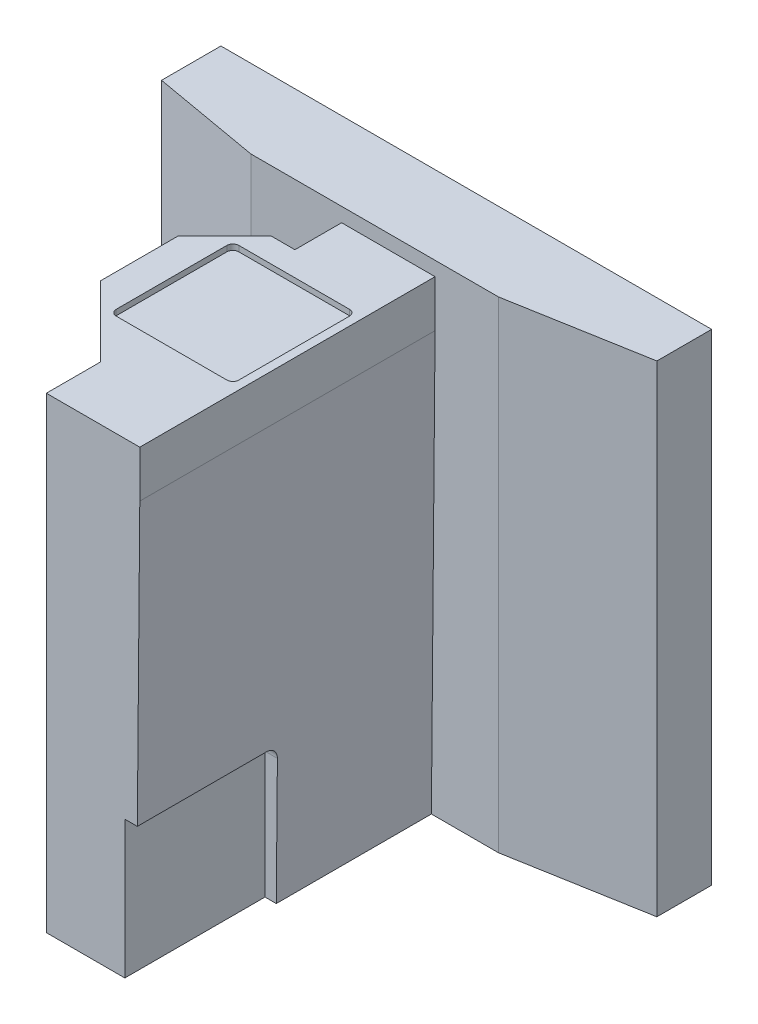
ISO-10303-21;
HEADER;
FILE_DESCRIPTION(('STEP AP214'),'2;1');
FILE_NAME('part.step','',(''),(''),'','','');
FILE_SCHEMA(('AUTOMOTIVE_DESIGN { 1 0 10303 214 1 1 1 1 }'));
ENDSEC;
DATA;
#1=APPLICATION_CONTEXT('core data for automotive mechanical design processes');
#2=APPLICATION_PROTOCOL_DEFINITION('international standard','automotive_design',2000,#1);
#3=PRODUCT_CONTEXT('',#1,'mechanical');
#4=PRODUCT('Part','Part','',(#3));
#5=PRODUCT_RELATED_PRODUCT_CATEGORY('part','',(#4));
#6=PRODUCT_DEFINITION_FORMATION('','',#4);
#7=PRODUCT_DEFINITION_CONTEXT('part definition',#1,'design');
#8=PRODUCT_DEFINITION('design','',#6,#7);
#9=PRODUCT_DEFINITION_SHAPE('','',#8);
#10=(LENGTH_UNIT() NAMED_UNIT(*) SI_UNIT(.MILLI.,.METRE.));
#11=(NAMED_UNIT(*) PLANE_ANGLE_UNIT() SI_UNIT($,.RADIAN.));
#12=(NAMED_UNIT(*) SI_UNIT($,.STERADIAN.) SOLID_ANGLE_UNIT());
#13=UNCERTAINTY_MEASURE_WITH_UNIT(LENGTH_MEASURE(1.E-05),#10,'distance_accuracy_value','');
#14=(GEOMETRIC_REPRESENTATION_CONTEXT(3) GLOBAL_UNCERTAINTY_ASSIGNED_CONTEXT((#13)) GLOBAL_UNIT_ASSIGNED_CONTEXT((#10,
#11,#12)) REPRESENTATION_CONTEXT('',''));
#15=CARTESIAN_POINT('',(0.,0.,0.));
#16=DIRECTION('',(0.,0.,1.));
#17=DIRECTION('',(1.,0.,0.));
#18=AXIS2_PLACEMENT_3D('',#15,#16,#17);
#19=CARTESIAN_POINT('',(16.6751,32.7152000000001,5.334));
#20=DIRECTION('',(0.,0.,-1.));
#21=DIRECTION('',(-1.,0.,0.));
#22=AXIS2_PLACEMENT_3D('',#19,#20,#21);
#23=PLANE('',#22);
#24=DIRECTION('',(1.,0.,0.));
#25=VECTOR('',#24,1.);
#26=CARTESIAN_POINT('',(16.6751,0.,5.334));
#27=LINE('',#26,#25);
#28=CARTESIAN_POINT('',(2.96372975287907,0.,5.334));
#29=VERTEX_POINT('',#28);
#30=CARTESIAN_POINT('',(7.53109999999983,0.,5.334));
#31=VERTEX_POINT('',#30);
#32=EDGE_CURVE('E323',#29,#31,#27,.T.);
#33=ORIENTED_EDGE('',*,*,#32,.T.);
#34=DIRECTION('',(0.,1.,0.));
#35=VECTOR('',#34,1.);
#36=CARTESIAN_POINT('',(7.53109999999985,32.7152000000001,5.334));
#37=LINE('',#36,#35);
#38=CARTESIAN_POINT('',(7.53109999999985,32.7152000000001,5.334));
#39=VERTEX_POINT('',#38);
#40=EDGE_CURVE('E393',#31,#39,#37,.T.);
#41=ORIENTED_EDGE('',*,*,#40,.T.);
#42=DIRECTION('',(1.,0.,0.));
#43=VECTOR('',#42,1.);
#44=CARTESIAN_POINT('',(16.6751,32.7152000000001,5.334));
#45=LINE('',#44,#43);
#46=CARTESIAN_POINT('',(-9.30909999999983,32.7152000000001,5.334));
#47=VERTEX_POINT('',#46);
#48=EDGE_CURVE('E308',#47,#39,#45,.T.);
#49=ORIENTED_EDGE('',*,*,#48,.F.);
#50=DIRECTION('',(0.,-1.,0.));
#51=VECTOR('',#50,1.);
#52=CARTESIAN_POINT('',(-9.30909999999983,32.7152000000001,5.334));
#53=LINE('',#52,#51);
#54=CARTESIAN_POINT('',(-9.30909999999985,0.,5.334));
#55=VERTEX_POINT('',#54);
#56=EDGE_CURVE('E349',#47,#55,#53,.T.);
#57=ORIENTED_EDGE('',*,*,#56,.T.);
#58=CARTESIAN_POINT('',(-3.13689999999999,0.,5.334));
#59=VERTEX_POINT('',#58);
#60=EDGE_CURVE('E324',#55,#59,#27,.T.);
#61=ORIENTED_EDGE('',*,*,#60,.T.);
#62=DIRECTION('',(0.,-1.,0.));
#63=VECTOR('',#62,1.);
#64=CARTESIAN_POINT('',(-3.13689999999997,28.5750000000001,5.334));
#65=LINE('',#64,#63);
#66=CARTESIAN_POINT('',(-3.13689999999997,31.7500000000001,5.334));
#67=VERTEX_POINT('',#66);
#68=EDGE_CURVE('E299',#67,#59,#65,.T.);
#69=ORIENTED_EDGE('',*,*,#68,.F.);
#70=DIRECTION('',(-1.,0.,0.));
#71=VECTOR('',#70,1.);
#72=CARTESIAN_POINT('',(3.21310000000003,31.7500000000001,5.334));
#73=LINE('',#72,#71);
#74=CARTESIAN_POINT('',(3.21310000000003,31.7500000000001,5.334));
#75=VERTEX_POINT('',#74);
#76=EDGE_CURVE('E589',#75,#67,#73,.T.);
#77=ORIENTED_EDGE('',*,*,#76,.F.);
#78=DIRECTION('',(0.,-1.,0.));
#79=VECTOR('',#78,1.);
#80=CARTESIAN_POINT('',(3.21310000000005,55.6589231294315,5.334));
#81=LINE('',#80,#79);
#82=CARTESIAN_POINT('',(3.21310000000003,28.5750000000001,5.334));
#83=VERTEX_POINT('',#82);
#84=EDGE_CURVE('E621',#75,#83,#81,.T.);
#85=ORIENTED_EDGE('',*,*,#84,.T.);
#86=DIRECTION('',(0.00872653549837484,0.999961923064175,0.));
#87=VECTOR('',#86,1.);
#88=CARTESIAN_POINT('',(3.21310000000003,28.5750000000001,5.334));
#89=LINE('',#88,#87);
#90=EDGE_CURVE('E355',#83,#29,#89,.F.);
#91=ORIENTED_EDGE('',*,*,#90,.T.);
#92=EDGE_LOOP('',(#33,#41,#49,#57,#61,#69,#77,#85,#91));
#93=FACE_BOUND('',#92,.T.);
#94=ADVANCED_FACE('F48',(#93),#23,.F.);
#95=CARTESIAN_POINT('',(-16.6751,32.7152000000001,5.334));
#96=DIRECTION('',(1.,0.,0.));
#97=DIRECTION('',(0.,0.,-1.));
#98=AXIS2_PLACEMENT_3D('',#95,#96,#97);
#99=PLANE('',#98);
#100=DIRECTION('',(0.,0.,1.));
#101=VECTOR('',#100,1.);
#102=CARTESIAN_POINT('',(-16.6751,0.,5.334));
#103=LINE('',#102,#101);
#104=CARTESIAN_POINT('',(-16.6751,0.,0.));
#105=VERTEX_POINT('',#104);
#106=CARTESIAN_POINT('',(-16.6751,0.,4.03517546010146));
#107=VERTEX_POINT('',#106);
#108=EDGE_CURVE('E303',#105,#107,#103,.T.);
#109=ORIENTED_EDGE('',*,*,#108,.T.);
#110=DIRECTION('',(0.,1.,0.));
#111=VECTOR('',#110,1.);
#112=CARTESIAN_POINT('',(-16.6751,32.7152000000001,4.03517546010146));
#113=LINE('',#112,#111);
#114=CARTESIAN_POINT('',(-16.6751,32.7152000000001,4.03517546010146));
#115=VERTEX_POINT('',#114);
#116=EDGE_CURVE('E380',#107,#115,#113,.T.);
#117=ORIENTED_EDGE('',*,*,#116,.T.);
#118=DIRECTION('',(0.,0.,1.));
#119=VECTOR('',#118,1.);
#120=CARTESIAN_POINT('',(-16.6751,32.7152000000001,5.334));
#121=LINE('',#120,#119);
#122=CARTESIAN_POINT('',(-16.6751,32.7152000000001,0.));
#123=VERTEX_POINT('',#122);
#124=EDGE_CURVE('E304',#123,#115,#121,.T.);
#125=ORIENTED_EDGE('',*,*,#124,.F.);
#126=DIRECTION('',(0.,-1.,0.));
#127=VECTOR('',#126,1.);
#128=CARTESIAN_POINT('',(-16.6751,32.7152000000001,0.));
#129=LINE('',#128,#127);
#130=EDGE_CURVE('E319',#123,#105,#129,.T.);
#131=ORIENTED_EDGE('',*,*,#130,.T.);
#132=EDGE_LOOP('',(#109,#117,#125,#131));
#133=FACE_BOUND('',#132,.T.);
#134=ADVANCED_FACE('F479',(#133),#99,.F.);
#135=CARTESIAN_POINT('',(16.6751,32.7152000000001,5.334));
#136=DIRECTION('',(-1.,0.,0.));
#137=DIRECTION('',(0.,0.,1.));
#138=AXIS2_PLACEMENT_3D('',#135,#136,#137);
#139=PLANE('',#138);
#140=DIRECTION('',(0.,0.,-1.));
#141=VECTOR('',#140,1.);
#142=CARTESIAN_POINT('',(16.6751,32.7152000000001,5.334));
#143=LINE('',#142,#141);
#144=CARTESIAN_POINT('',(16.6751,32.7152000000001,3.7216660884018));
#145=VERTEX_POINT('',#144);
#146=CARTESIAN_POINT('',(16.6751,32.7152000000001,0.));
#147=VERTEX_POINT('',#146);
#148=EDGE_CURVE('E313',#145,#147,#143,.T.);
#149=ORIENTED_EDGE('',*,*,#148,.F.);
#150=DIRECTION('',(0.,-1.,0.));
#151=VECTOR('',#150,1.);
#152=CARTESIAN_POINT('',(16.6751,32.7152000000001,3.7216660884018));
#153=LINE('',#152,#151);
#154=CARTESIAN_POINT('',(16.6751,0.,3.7216660884018));
#155=VERTEX_POINT('',#154);
#156=EDGE_CURVE('E386',#145,#155,#153,.T.);
#157=ORIENTED_EDGE('',*,*,#156,.T.);
#158=DIRECTION('',(0.,0.,-1.));
#159=VECTOR('',#158,1.);
#160=CARTESIAN_POINT('',(16.6751,0.,5.334));
#161=LINE('',#160,#159);
#162=CARTESIAN_POINT('',(16.6751,0.,0.));
#163=VERTEX_POINT('',#162);
#164=EDGE_CURVE('E327',#155,#163,#161,.T.);
#165=ORIENTED_EDGE('',*,*,#164,.T.);
#166=DIRECTION('',(0.,-1.,0.));
#167=VECTOR('',#166,1.);
#168=CARTESIAN_POINT('',(16.6751,32.7152000000001,0.));
#169=LINE('',#168,#167);
#170=EDGE_CURVE('E335',#147,#163,#169,.T.);
#171=ORIENTED_EDGE('',*,*,#170,.F.);
#172=EDGE_LOOP('',(#149,#157,#165,#171));
#173=FACE_BOUND('',#172,.T.);
#174=ADVANCED_FACE('F485',(#173),#139,.F.);
#175=CARTESIAN_POINT('',(16.6751,32.7152000000001,0.));
#176=DIRECTION('',(0.,0.,1.));
#177=DIRECTION('',(1.,0.,0.));
#178=AXIS2_PLACEMENT_3D('',#175,#176,#177);
#179=PLANE('',#178);
#180=CARTESIAN_POINT('',(0.,4.77520000000001,0.));
#181=DIRECTION('',(0.,0.,-1.));
#182=DIRECTION('',(-1.,0.,0.));
#183=AXIS2_PLACEMENT_3D('',#180,#181,#182);
#184=CIRCLE('',#183,1.24999999999999);
#185=CARTESIAN_POINT('',(-1.24999999999998,4.77520000000001,0.));
#186=VERTEX_POINT('',#185);
#187=EDGE_CURVE('E760',#186,#186,#184,.T.);
#188=ORIENTED_EDGE('',*,*,#187,.F.);
#189=EDGE_LOOP('',(#188));
#190=FACE_BOUND('',#189,.T.);
#191=CARTESIAN_POINT('',(0.,23.8252000000001,0.));
#192=DIRECTION('',(0.,0.,-1.));
#193=DIRECTION('',(-1.,0.,0.));
#194=AXIS2_PLACEMENT_3D('',#191,#192,#193);
#195=CIRCLE('',#194,1.24999999999999);
#196=CARTESIAN_POINT('',(-1.24999999999997,23.8252000000001,0.));
#197=VERTEX_POINT('',#196);
#198=EDGE_CURVE('E770',#197,#197,#195,.T.);
#199=ORIENTED_EDGE('',*,*,#198,.F.);
#200=EDGE_LOOP('',(#199));
#201=FACE_BOUND('',#200,.T.);
#202=DIRECTION('',(-1.,0.,0.));
#203=VECTOR('',#202,1.);
#204=CARTESIAN_POINT('',(16.6751,0.,0.));
#205=LINE('',#204,#203);
#206=EDGE_CURVE('E309',#163,#105,#205,.T.);
#207=ORIENTED_EDGE('',*,*,#206,.T.);
#208=ORIENTED_EDGE('',*,*,#130,.F.);
#209=DIRECTION('',(-1.,0.,0.));
#210=VECTOR('',#209,1.);
#211=CARTESIAN_POINT('',(16.6751,32.7152000000001,0.));
#212=LINE('',#211,#210);
#213=EDGE_CURVE('E316',#147,#123,#212,.T.);
#214=ORIENTED_EDGE('',*,*,#213,.F.);
#215=ORIENTED_EDGE('',*,*,#170,.T.);
#216=EDGE_LOOP('',(#207,#208,#214,#215));
#217=FACE_BOUND('',#216,.T.);
#218=ADVANCED_FACE('F691',(#190,#201,#217),#179,.F.);
#219=CARTESIAN_POINT('',(0.,32.7152000000001,0.));
#220=DIRECTION('',(0.,1.,0.));
#221=DIRECTION('',(0.,0.,1.));
#222=AXIS2_PLACEMENT_3D('',#219,#220,#221);
#223=PLANE('',#222);
#224=ORIENTED_EDGE('',*,*,#48,.T.);
#225=DIRECTION('',(-0.984807753012209,0.,0.173648177666927));
#226=VECTOR('',#225,1.);
#227=CARTESIAN_POINT('',(1.13925817404918,32.7152000000001,6.46105417033595));
#228=LINE('',#227,#226);
#229=EDGE_CURVE('E396',#39,#145,#228,.F.);
#230=ORIENTED_EDGE('',*,*,#229,.T.);
#231=ORIENTED_EDGE('',*,*,#148,.T.);
#232=ORIENTED_EDGE('',*,*,#213,.T.);
#233=ORIENTED_EDGE('',*,*,#124,.T.);
#234=DIRECTION('',(-0.984807753012209,0.,-0.173648177666927));
#235=VECTOR('',#234,1.);
#236=CARTESIAN_POINT('',(-1.19287143417045,32.7152000000001,6.76511007775248));
#237=LINE('',#236,#235);
#238=EDGE_CURVE('E383',#115,#47,#237,.F.);
#239=ORIENTED_EDGE('',*,*,#238,.T.);
#240=EDGE_LOOP('',(#224,#230,#231,#232,#233,#239));
#241=FACE_BOUND('',#240,.T.);
#242=ADVANCED_FACE('F685',(#241),#223,.T.);
#243=CARTESIAN_POINT('',(0.,0.,0.));
#244=DIRECTION('',(0.,1.,0.));
#245=DIRECTION('',(0.,0.,1.));
#246=AXIS2_PLACEMENT_3D('',#243,#244,#245);
#247=PLANE('',#246);
#248=DIRECTION('',(0.,0.,1.));
#249=VECTOR('',#248,1.);
#250=CARTESIAN_POINT('',(2.96372975287907,0.,5.334));
#251=LINE('',#250,#249);
#252=CARTESIAN_POINT('',(2.96372975287907,0.,15.875));
#253=VERTEX_POINT('',#252);
#254=EDGE_CURVE('E279',#253,#29,#251,.F.);
#255=ORIENTED_EDGE('',*,*,#254,.F.);
#256=DIRECTION('',(1.,0.,0.));
#257=VECTOR('',#256,1.);
#258=CARTESIAN_POINT('',(2.1971,0.,15.875));
#259=LINE('',#258,#257);
#260=CARTESIAN_POINT('',(2.1971,0.,15.875));
#261=VERTEX_POINT('',#260);
#262=EDGE_CURVE('E270',#261,#253,#259,.T.);
#263=ORIENTED_EDGE('',*,*,#262,.F.);
#264=DIRECTION('',(0.,0.,-1.));
#265=VECTOR('',#264,1.);
#266=CARTESIAN_POINT('',(2.1971,0.,25.4));
#267=LINE('',#266,#265);
#268=CARTESIAN_POINT('',(2.1971,0.,25.4));
#269=VERTEX_POINT('',#268);
#270=EDGE_CURVE('E253',#269,#261,#267,.T.);
#271=ORIENTED_EDGE('',*,*,#270,.F.);
#272=DIRECTION('',(1.,0.,0.));
#273=VECTOR('',#272,1.);
#274=CARTESIAN_POINT('',(3.2131,0.,25.4));
#275=LINE('',#274,#273);
#276=CARTESIAN_POINT('',(-3.1369,0.,25.4));
#277=VERTEX_POINT('',#276);
#278=EDGE_CURVE('E268',#277,#269,#275,.T.);
#279=ORIENTED_EDGE('',*,*,#278,.F.);
#280=DIRECTION('',(0.,0.,1.));
#281=VECTOR('',#280,1.);
#282=CARTESIAN_POINT('',(-3.1369,0.,25.4));
#283=LINE('',#282,#281);
#284=CARTESIAN_POINT('',(-3.1369,0.,21.3643372144693));
#285=VERTEX_POINT('',#284);
#286=EDGE_CURVE('E280',#285,#277,#283,.T.);
#287=ORIENTED_EDGE('',*,*,#286,.F.);
#288=DIRECTION('',(-0.707106781186547,0.,-0.707106781186549));
#289=VECTOR('',#288,1.);
#290=CARTESIAN_POINT('',(-2.96056860723462,0.,21.5406686072346));
#291=LINE('',#290,#289);
#292=CARTESIAN_POINT('',(-7.9121,0.,16.5891372144692));
#293=VERTEX_POINT('',#292);
#294=EDGE_CURVE('E344',#285,#293,#291,.T.);
#295=ORIENTED_EDGE('',*,*,#294,.T.);
#296=DIRECTION('',(0.,0.,1.));
#297=VECTOR('',#296,1.);
#298=CARTESIAN_POINT('',(-7.91209999999999,0.,21.717));
#299=LINE('',#298,#297);
#300=CARTESIAN_POINT('',(-7.9121,0.,12.0366627855308));
#301=VERTEX_POINT('',#300);
#302=EDGE_CURVE('E287',#301,#293,#299,.T.);
#303=ORIENTED_EDGE('',*,*,#302,.F.);
#304=DIRECTION('',(0.707106781186548,0.,-0.707106781186547));
#305=VECTOR('',#304,1.);
#306=CARTESIAN_POINT('',(-7.73576860723462,0.,11.8603313927654));
#307=LINE('',#306,#305);
#308=CARTESIAN_POINT('',(-4.38443721446922,0.,8.509));
#309=VERTEX_POINT('',#308);
#310=EDGE_CURVE('E369',#301,#309,#307,.T.);
#311=ORIENTED_EDGE('',*,*,#310,.T.);
#312=DIRECTION('',(-1.,0.,0.));
#313=VECTOR('',#312,1.);
#314=CARTESIAN_POINT('',(-7.9121,0.,8.509));
#315=LINE('',#314,#313);
#316=CARTESIAN_POINT('',(-3.1369,0.,8.509));
#317=VERTEX_POINT('',#316);
#318=EDGE_CURVE('E648',#317,#309,#315,.T.);
#319=ORIENTED_EDGE('',*,*,#318,.F.);
#320=DIRECTION('',(0.,0.,1.));
#321=VECTOR('',#320,1.);
#322=CARTESIAN_POINT('',(-3.1369,0.,8.509));
#323=LINE('',#322,#321);
#324=EDGE_CURVE('E588',#59,#317,#323,.T.);
#325=ORIENTED_EDGE('',*,*,#324,.F.);
#326=ORIENTED_EDGE('',*,*,#60,.F.);
#327=DIRECTION('',(0.984807753012209,0.,0.173648177666927));
#328=VECTOR('',#327,1.);
#329=CARTESIAN_POINT('',(-9.30909999999985,0.,5.334));
#330=LINE('',#329,#328);
#331=EDGE_CURVE('E377',#55,#107,#330,.F.);
#332=ORIENTED_EDGE('',*,*,#331,.T.);
#333=ORIENTED_EDGE('',*,*,#108,.F.);
#334=ORIENTED_EDGE('',*,*,#206,.F.);
#335=ORIENTED_EDGE('',*,*,#164,.F.);
#336=DIRECTION('',(0.984807753012209,0.,-0.173648177666927));
#337=VECTOR('',#336,1.);
#338=CARTESIAN_POINT('',(16.6751,0.,3.7216660884018));
#339=LINE('',#338,#337);
#340=EDGE_CURVE('E390',#155,#31,#339,.F.);
#341=ORIENTED_EDGE('',*,*,#340,.T.);
#342=ORIENTED_EDGE('',*,*,#32,.F.);
#343=EDGE_LOOP('',(#255,#263,#271,#279,#287,#295,#303,#311,#319,#325,#326,#332,#333,#334,#335,
#341,#342));
#344=FACE_BOUND('',#343,.T.);
#345=ADVANCED_FACE('F266',(#344),#247,.F.);
#346=CARTESIAN_POINT('',(-3.13689999999997,28.5750000000001,8.509));
#347=DIRECTION('',(1.,0.,0.));
#348=DIRECTION('',(0.,0.,-1.));
#349=AXIS2_PLACEMENT_3D('',#346,#347,#348);
#350=PLANE('',#349);
#351=ORIENTED_EDGE('',*,*,#324,.T.);
#352=DIRECTION('',(0.,-1.,0.));
#353=VECTOR('',#352,1.);
#354=CARTESIAN_POINT('',(-3.13689999999997,28.5750000000001,8.509));
#355=LINE('',#354,#353);
#356=CARTESIAN_POINT('',(-3.13689999999997,31.7500000000001,8.509));
#357=VERTEX_POINT('',#356);
#358=EDGE_CURVE('E295',#357,#317,#355,.T.);
#359=ORIENTED_EDGE('',*,*,#358,.F.);
#360=DIRECTION('',(0.,0.,1.));
#361=VECTOR('',#360,1.);
#362=CARTESIAN_POINT('',(-3.13689999999997,31.7500000000001,5.334));
#363=LINE('',#362,#361);
#364=EDGE_CURVE('E584',#67,#357,#363,.T.);
#365=ORIENTED_EDGE('',*,*,#364,.F.);
#366=ORIENTED_EDGE('',*,*,#68,.T.);
#367=EDGE_LOOP('',(#351,#359,#365,#366));
#368=FACE_BOUND('',#367,.T.);
#369=ADVANCED_FACE('F676',(#368),#350,.F.);
#370=CARTESIAN_POINT('',(-7.91209999999997,28.5750000000001,8.509));
#371=DIRECTION('',(0.,0.,1.));
#372=DIRECTION('',(1.,0.,0.));
#373=AXIS2_PLACEMENT_3D('',#370,#371,#372);
#374=PLANE('',#373);
#375=ORIENTED_EDGE('',*,*,#318,.T.);
#376=DIRECTION('',(-0.0123407149756092,0.999923850477574,0.));
#377=VECTOR('',#376,1.);
#378=CARTESIAN_POINT('',(-4.73758353105635,28.6141787863746,8.509));
#379=LINE('',#378,#377);
#380=CARTESIAN_POINT('',(-4.73709999999995,28.5750000000001,8.509));
#381=VERTEX_POINT('',#380);
#382=EDGE_CURVE('E345',#309,#381,#379,.T.);
#383=ORIENTED_EDGE('',*,*,#382,.T.);
#384=DIRECTION('',(0.,-1.,0.));
#385=VECTOR('',#384,1.);
#386=CARTESIAN_POINT('',(-4.73709999999993,55.6589231294315,8.509));
#387=LINE('',#386,#385);
#388=CARTESIAN_POINT('',(-4.73709999999995,31.7500000000001,8.509));
#389=VERTEX_POINT('',#388);
#390=EDGE_CURVE('E568',#389,#381,#387,.T.);
#391=ORIENTED_EDGE('',*,*,#390,.F.);
#392=DIRECTION('',(-1.,0.,0.));
#393=VECTOR('',#392,1.);
#394=CARTESIAN_POINT('',(-3.13689999999997,31.7500000000001,8.509));
#395=LINE('',#394,#393);
#396=EDGE_CURVE('E617',#357,#389,#395,.T.);
#397=ORIENTED_EDGE('',*,*,#396,.F.);
#398=ORIENTED_EDGE('',*,*,#358,.T.);
#399=EDGE_LOOP('',(#375,#383,#391,#397,#398));
#400=FACE_BOUND('',#399,.T.);
#401=ADVANCED_FACE('F673',(#400),#374,.F.);
#402=CARTESIAN_POINT('',(-7.91209999999996,28.5750000000001,21.717));
#403=DIRECTION('',(1.,0.,0.));
#404=DIRECTION('',(0.,0.,-1.));
#405=AXIS2_PLACEMENT_3D('',#402,#403,#404);
#406=PLANE('',#405);
#407=ORIENTED_EDGE('',*,*,#302,.T.);
#408=DIRECTION('',(0.,0.999923850477574,0.0123407149756101));
#409=VECTOR('',#408,1.);
#410=CARTESIAN_POINT('',(-7.91209999999997,28.6339248947073,16.9425272307088));
#411=LINE('',#410,#409);
#412=CARTESIAN_POINT('',(-7.91209999999997,28.5750000000001,16.9418));
#413=VERTEX_POINT('',#412);
#414=EDGE_CURVE('E350',#293,#413,#411,.T.);
#415=ORIENTED_EDGE('',*,*,#414,.T.);
#416=DIRECTION('',(0.,-1.,0.));
#417=VECTOR('',#416,1.);
#418=CARTESIAN_POINT('',(-7.91209999999995,55.6589231294315,16.9418));
#419=LINE('',#418,#417);
#420=CARTESIAN_POINT('',(-7.91209999999997,31.7500000000001,16.9418));
#421=VERTEX_POINT('',#420);
#422=EDGE_CURVE('E626',#421,#413,#419,.T.);
#423=ORIENTED_EDGE('',*,*,#422,.F.);
#424=DIRECTION('',(0.,0.,1.));
#425=VECTOR('',#424,1.);
#426=CARTESIAN_POINT('',(-7.91209999999997,31.7500000000001,11.684));
#427=LINE('',#426,#425);
#428=CARTESIAN_POINT('',(-7.91209999999997,31.7500000000001,11.684));
#429=VERTEX_POINT('',#428);
#430=EDGE_CURVE('E609',#429,#421,#427,.T.);
#431=ORIENTED_EDGE('',*,*,#430,.F.);
#432=DIRECTION('',(0.,-1.,0.));
#433=VECTOR('',#432,1.);
#434=CARTESIAN_POINT('',(-7.91209999999994,55.6589231294315,11.684));
#435=LINE('',#434,#433);
#436=CARTESIAN_POINT('',(-7.91209999999996,28.5750000000001,11.684));
#437=VERTEX_POINT('',#436);
#438=EDGE_CURVE('E622',#429,#437,#435,.T.);
#439=ORIENTED_EDGE('',*,*,#438,.T.);
#440=DIRECTION('',(0.,-0.999923850477574,0.01234071497561));
#441=VECTOR('',#440,1.);
#442=CARTESIAN_POINT('',(-7.91209999999996,28.5750000000001,11.684));
#443=LINE('',#442,#441);
#444=EDGE_CURVE('E339',#437,#301,#443,.T.);
#445=ORIENTED_EDGE('',*,*,#444,.T.);
#446=EDGE_LOOP('',(#407,#415,#423,#431,#439,#445));
#447=FACE_BOUND('',#446,.T.);
#448=ADVANCED_FACE('F657',(#447),#406,.F.);
#449=CARTESIAN_POINT('',(-3.13689999999997,28.5750000000001,25.4));
#450=DIRECTION('',(1.,0.,0.));
#451=DIRECTION('',(0.,0.,-1.));
#452=AXIS2_PLACEMENT_3D('',#449,#450,#451);
#453=PLANE('',#452);
#454=ORIENTED_EDGE('',*,*,#286,.T.);
#455=DIRECTION('',(0.,-1.,0.));
#456=VECTOR('',#455,1.);
#457=CARTESIAN_POINT('',(-3.13689999999997,28.5750000000001,25.4));
#458=LINE('',#457,#456);
#459=CARTESIAN_POINT('',(-3.13689999999997,31.7500000000001,25.4));
#460=VERTEX_POINT('',#459);
#461=EDGE_CURVE('E277',#460,#277,#458,.T.);
#462=ORIENTED_EDGE('',*,*,#461,.F.);
#463=DIRECTION('',(0.,0.,1.));
#464=VECTOR('',#463,1.);
#465=CARTESIAN_POINT('',(-3.13689999999997,31.7500000000001,21.717));
#466=LINE('',#465,#464);
#467=CARTESIAN_POINT('',(-3.13689999999997,31.7500000000001,21.717));
#468=VERTEX_POINT('',#467);
#469=EDGE_CURVE('E601',#468,#460,#466,.T.);
#470=ORIENTED_EDGE('',*,*,#469,.F.);
#471=DIRECTION('',(0.,-1.,0.));
#472=VECTOR('',#471,1.);
#473=CARTESIAN_POINT('',(-3.13689999999995,55.6589231294315,21.717));
#474=LINE('',#473,#472);
#475=CARTESIAN_POINT('',(-3.13689999999997,28.5750000000001,21.717));
#476=VERTEX_POINT('',#475);
#477=EDGE_CURVE('E630',#468,#476,#474,.T.);
#478=ORIENTED_EDGE('',*,*,#477,.T.);
#479=DIRECTION('',(0.,-0.999923850477574,-0.0123407149756101));
#480=VECTOR('',#479,1.);
#481=CARTESIAN_POINT('',(-3.13689999999997,28.6204473921945,21.7175608960254));
#482=LINE('',#481,#480);
#483=EDGE_CURVE('E293',#476,#285,#482,.T.);
#484=ORIENTED_EDGE('',*,*,#483,.T.);
#485=EDGE_LOOP('',(#454,#462,#470,#478,#484));
#486=FACE_BOUND('',#485,.T.);
#487=ADVANCED_FACE('F802',(#486),#453,.F.);
#488=CARTESIAN_POINT('',(3.21310000000003,28.5750000000001,25.4));
#489=DIRECTION('',(0.,0.,-1.));
#490=DIRECTION('',(-1.,0.,0.));
#491=AXIS2_PLACEMENT_3D('',#488,#489,#490);
#492=PLANE('',#491);
#493=DIRECTION('',(0.,-1.,0.));
#494=VECTOR('',#493,1.);
#495=CARTESIAN_POINT('',(2.1971,0.,25.4));
#496=LINE('',#495,#494);
#497=CARTESIAN_POINT('',(2.19710000000001,9.34720000000001,25.4));
#498=VERTEX_POINT('',#497);
#499=EDGE_CURVE('E250',#498,#269,#496,.T.);
#500=ORIENTED_EDGE('',*,*,#499,.F.);
#501=DIRECTION('',(1.,0.,0.));
#502=VECTOR('',#501,1.);
#503=CARTESIAN_POINT('',(2.19710000000001,9.34720000000001,25.4));
#504=LINE('',#503,#502);
#505=CARTESIAN_POINT('',(3.04530153149286,9.34720000000001,25.4));
#506=VERTEX_POINT('',#505);
#507=EDGE_CURVE('E469',#498,#506,#504,.T.);
#508=ORIENTED_EDGE('',*,*,#507,.T.);
#509=DIRECTION('',(0.00872653549837484,0.999961923064175,0.));
#510=VECTOR('',#509,1.);
#511=CARTESIAN_POINT('',(3.21310000000003,28.5750000000001,25.4));
#512=LINE('',#511,#510);
#513=CARTESIAN_POINT('',(3.21310000000003,28.5750000000001,25.4));
#514=VERTEX_POINT('',#513);
#515=EDGE_CURVE('E294',#514,#506,#512,.F.);
#516=ORIENTED_EDGE('',*,*,#515,.F.);
#517=DIRECTION('',(0.,-1.,0.));
#518=VECTOR('',#517,1.);
#519=CARTESIAN_POINT('',(3.21310000000005,55.6589231294315,25.4));
#520=LINE('',#519,#518);
#521=CARTESIAN_POINT('',(3.21310000000003,31.7500000000001,25.4));
#522=VERTEX_POINT('',#521);
#523=EDGE_CURVE('E634',#522,#514,#520,.T.);
#524=ORIENTED_EDGE('',*,*,#523,.F.);
#525=DIRECTION('',(1.,0.,0.));
#526=VECTOR('',#525,1.);
#527=CARTESIAN_POINT('',(-3.13689999999997,31.7500000000001,25.4));
#528=LINE('',#527,#526);
#529=EDGE_CURVE('E597',#460,#522,#528,.T.);
#530=ORIENTED_EDGE('',*,*,#529,.F.);
#531=ORIENTED_EDGE('',*,*,#461,.T.);
#532=ORIENTED_EDGE('',*,*,#278,.T.);
#533=EDGE_LOOP('',(#500,#508,#516,#524,#530,#531,#532));
#534=FACE_BOUND('',#533,.T.);
#535=ADVANCED_FACE('F275',(#534),#492,.F.);
#536=CARTESIAN_POINT('',(3.21310000000003,28.5750000000001,5.334));
#537=DIRECTION('',(0.999961923064171,-0.00872653549837309,0.));
#538=DIRECTION('',(0.00872653549837484,0.999961923064175,0.));
#539=AXIS2_PLACEMENT_3D('',#536,#537,#538);
#540=PLANE('',#539);
#541=ORIENTED_EDGE('',*,*,#515,.T.);
#542=DIRECTION('',(0.,0.,1.));
#543=VECTOR('',#542,1.);
#544=CARTESIAN_POINT('',(3.04530153149286,9.34720000000001,5.334));
#545=LINE('',#544,#543);
#546=CARTESIAN_POINT('',(3.04530153149286,9.34720000000001,16.637));
#547=VERTEX_POINT('',#546);
#548=EDGE_CURVE('E454',#506,#547,#545,.F.);
#549=ORIENTED_EDGE('',*,*,#548,.T.);
#550=CARTESIAN_POINT('',(3.0386516582363,8.58520000000001,16.637));
#551=DIRECTION('',(0.999961923064171,-0.00872653549837309,0.));
#552=DIRECTION('',(-0.00872653549837484,-0.999961923064175,0.));
#553=AXIS2_PLACEMENT_3D('',#550,#551,#552);
#554=ELLIPSE('',#553,0.762029015729932,0.762);
#555=CARTESIAN_POINT('',(3.0386516582363,8.58520000000001,15.875));
#556=VERTEX_POINT('',#555);
#557=EDGE_CURVE('E12',#547,#556,#554,.F.);
#558=ORIENTED_EDGE('',*,*,#557,.T.);
#559=DIRECTION('',(0.00872653549837484,0.999961923064175,0.));
#560=VECTOR('',#559,1.);
#561=CARTESIAN_POINT('',(3.21310000000003,28.5750000000001,15.875));
#562=LINE('',#561,#560);
#563=EDGE_CURVE('E451',#556,#253,#562,.F.);
#564=ORIENTED_EDGE('',*,*,#563,.T.);
#565=ORIENTED_EDGE('',*,*,#254,.T.);
#566=ORIENTED_EDGE('',*,*,#90,.F.);
#567=DIRECTION('',(0.,0.,-1.));
#568=VECTOR('',#567,1.);
#569=CARTESIAN_POINT('',(3.21310000000003,28.5750000000001,5.334));
#570=LINE('',#569,#568);
#571=EDGE_CURVE('E285',#514,#83,#570,.T.);
#572=ORIENTED_EDGE('',*,*,#571,.F.);
#573=EDGE_LOOP('',(#541,#549,#558,#564,#565,#566,#572));
#574=FACE_BOUND('',#573,.T.);
#575=ADVANCED_FACE('F492',(#574),#540,.T.);
#576=CARTESIAN_POINT('',(-7.91209999999996,28.5750000000001,11.684));
#577=DIRECTION('',(-0.707079856727016,-0.00872653549837462,-0.707079856727017));
#578=DIRECTION('',(-0.707106781186548,0.,0.707106781186547));
#579=AXIS2_PLACEMENT_3D('',#576,#577,#578);
#580=PLANE('',#579);
#581=DIRECTION('',(0.707106781186548,0.,-0.707106781186547));
#582=VECTOR('',#581,1.);
#583=CARTESIAN_POINT('',(-7.91209999999996,28.5750000000001,11.684));
#584=LINE('',#583,#582);
#585=EDGE_CURVE('E340',#381,#437,#584,.F.);
#586=ORIENTED_EDGE('',*,*,#585,.F.);
#587=ORIENTED_EDGE('',*,*,#382,.F.);
#588=ORIENTED_EDGE('',*,*,#310,.F.);
#589=ORIENTED_EDGE('',*,*,#444,.F.);
#590=EDGE_LOOP('',(#586,#587,#588,#589));
#591=FACE_BOUND('',#590,.T.);
#592=ADVANCED_FACE('F495',(#591),#580,.T.);
#593=CARTESIAN_POINT('',(-3.13689999999997,28.5750000000001,21.717));
#594=DIRECTION('',(-0.707079856727017,-0.00872653549837462,0.707079856727015));
#595=DIRECTION('',(0.707106781186547,0.,0.707106781186549));
#596=AXIS2_PLACEMENT_3D('',#593,#594,#595);
#597=PLANE('',#596);
#598=DIRECTION('',(-0.707106781186546,0.,-0.707106781186549));
#599=VECTOR('',#598,1.);
#600=CARTESIAN_POINT('',(-3.13689999999997,28.5750000000001,21.717));
#601=LINE('',#600,#599);
#602=EDGE_CURVE('E346',#413,#476,#601,.F.);
#603=ORIENTED_EDGE('',*,*,#602,.F.);
#604=ORIENTED_EDGE('',*,*,#414,.F.);
#605=ORIENTED_EDGE('',*,*,#294,.F.);
#606=ORIENTED_EDGE('',*,*,#483,.F.);
#607=EDGE_LOOP('',(#603,#604,#605,#606));
#608=FACE_BOUND('',#607,.T.);
#609=ADVANCED_FACE('F498',(#608),#597,.T.);
#610=CARTESIAN_POINT('',(-4.73709999999993,55.6589231294315,8.509));
#611=DIRECTION('',(0.707106781186547,0.,0.707106781186548));
#612=DIRECTION('',(0.707106781186548,0.,-0.707106781186547));
#613=AXIS2_PLACEMENT_3D('',#610,#611,#612);
#614=PLANE('',#613);
#615=DIRECTION('',(-0.707106781186548,0.,0.707106781186547));
#616=VECTOR('',#615,1.);
#617=CARTESIAN_POINT('',(-4.73709999999995,31.7500000000001,8.509));
#618=LINE('',#617,#616);
#619=EDGE_CURVE('E613',#389,#429,#618,.T.);
#620=ORIENTED_EDGE('',*,*,#619,.F.);
#621=ORIENTED_EDGE('',*,*,#390,.T.);
#622=ORIENTED_EDGE('',*,*,#585,.T.);
#623=ORIENTED_EDGE('',*,*,#438,.F.);
#624=EDGE_LOOP('',(#620,#621,#622,#623));
#625=FACE_BOUND('',#624,.T.);
#626=ADVANCED_FACE('F502',(#625),#614,.F.);
#627=CARTESIAN_POINT('',(-7.91209999999995,55.6589231294315,16.9418));
#628=DIRECTION('',(0.707106781186549,0.,-0.707106781186546));
#629=DIRECTION('',(-0.707106781186546,0.,-0.707106781186549));
#630=AXIS2_PLACEMENT_3D('',#627,#628,#629);
#631=PLANE('',#630);
#632=DIRECTION('',(0.707106781186546,0.,0.707106781186549));
#633=VECTOR('',#632,1.);
#634=CARTESIAN_POINT('',(-7.91209999999997,31.7500000000001,16.9418));
#635=LINE('',#634,#633);
#636=EDGE_CURVE('E605',#421,#468,#635,.T.);
#637=ORIENTED_EDGE('',*,*,#636,.F.);
#638=ORIENTED_EDGE('',*,*,#422,.T.);
#639=ORIENTED_EDGE('',*,*,#602,.T.);
#640=ORIENTED_EDGE('',*,*,#477,.F.);
#641=EDGE_LOOP('',(#637,#638,#639,#640));
#642=FACE_BOUND('',#641,.T.);
#643=ADVANCED_FACE('F662',(#642),#631,.F.);
#644=CARTESIAN_POINT('',(3.21310000000005,55.6589231294315,25.4));
#645=DIRECTION('',(-1.,0.,0.));
#646=DIRECTION('',(0.,0.,1.));
#647=AXIS2_PLACEMENT_3D('',#644,#645,#646);
#648=PLANE('',#647);
#649=DIRECTION('',(0.,0.,-1.));
#650=VECTOR('',#649,1.);
#651=CARTESIAN_POINT('',(3.21310000000003,31.7500000000001,25.4));
#652=LINE('',#651,#650);
#653=EDGE_CURVE('E593',#522,#75,#652,.T.);
#654=ORIENTED_EDGE('',*,*,#653,.F.);
#655=ORIENTED_EDGE('',*,*,#523,.T.);
#656=ORIENTED_EDGE('',*,*,#571,.T.);
#657=ORIENTED_EDGE('',*,*,#84,.F.);
#658=EDGE_LOOP('',(#654,#655,#656,#657));
#659=FACE_BOUND('',#658,.T.);
#660=ADVANCED_FACE('F810',(#659),#648,.F.);
#661=CARTESIAN_POINT('',(0.,31.7500000000001,0.));
#662=DIRECTION('',(0.,1.,0.));
#663=DIRECTION('',(0.,0.,1.));
#664=AXIS2_PLACEMENT_3D('',#661,#662,#663);
#665=PLANE('',#664);
#666=DIRECTION('',(0.,0.,-1.));
#667=VECTOR('',#666,1.);
#668=CARTESIAN_POINT('',(2.62890000000003,31.7500000000001,18.4912));
#669=LINE('',#668,#667);
#670=CARTESIAN_POINT('',(2.62890000000003,31.7500000000001,18.0848));
#671=VERTEX_POINT('',#670);
#672=CARTESIAN_POINT('',(2.62890000000003,31.7500000000001,10.5664));
#673=VERTEX_POINT('',#672);
#674=EDGE_CURVE('E569',#671,#673,#669,.T.);
#675=ORIENTED_EDGE('',*,*,#674,.F.);
#676=CARTESIAN_POINT('',(2.22250000000003,31.7500000000001,18.0848));
#677=DIRECTION('',(0.,1.,0.));
#678=DIRECTION('',(0.,0.,1.));
#679=AXIS2_PLACEMENT_3D('',#676,#677,#678);
#680=CIRCLE('',#679,0.4064);
#681=CARTESIAN_POINT('',(2.22250000000003,31.7500000000001,18.4912));
#682=VERTEX_POINT('',#681);
#683=EDGE_CURVE('E439',#671,#682,#680,.F.);
#684=ORIENTED_EDGE('',*,*,#683,.T.);
#685=DIRECTION('',(1.,0.,0.));
#686=VECTOR('',#685,1.);
#687=CARTESIAN_POINT('',(-5.70229999999997,31.7500000000001,18.4912));
#688=LINE('',#687,#686);
#689=CARTESIAN_POINT('',(-5.29589999999997,31.7500000000001,18.4912));
#690=VERTEX_POINT('',#689);
#691=EDGE_CURVE('E562',#690,#682,#688,.T.);
#692=ORIENTED_EDGE('',*,*,#691,.F.);
#693=CARTESIAN_POINT('',(-5.29589999999997,31.7500000000001,18.0848));
#694=DIRECTION('',(0.,1.,0.));
#695=DIRECTION('',(0.,0.,1.));
#696=AXIS2_PLACEMENT_3D('',#693,#694,#695);
#697=CIRCLE('',#696,0.4064);
#698=CARTESIAN_POINT('',(-5.70229999999997,31.7500000000001,18.0848));
#699=VERTEX_POINT('',#698);
#700=EDGE_CURVE('E442',#690,#699,#697,.F.);
#701=ORIENTED_EDGE('',*,*,#700,.T.);
#702=DIRECTION('',(0.,0.,1.));
#703=VECTOR('',#702,1.);
#704=CARTESIAN_POINT('',(-5.70229999999997,31.7500000000001,18.4912));
#705=LINE('',#704,#703);
#706=CARTESIAN_POINT('',(-5.70229999999997,31.7500000000001,10.5664));
#707=VERTEX_POINT('',#706);
#708=EDGE_CURVE('E577',#707,#699,#705,.T.);
#709=ORIENTED_EDGE('',*,*,#708,.F.);
#710=CARTESIAN_POINT('',(-5.29589999999997,31.7500000000001,10.5664));
#711=DIRECTION('',(0.,1.,0.));
#712=DIRECTION('',(0.,0.,1.));
#713=AXIS2_PLACEMENT_3D('',#710,#711,#712);
#714=CIRCLE('',#713,0.4064);
#715=CARTESIAN_POINT('',(-5.29589999999997,31.7500000000001,10.16));
#716=VERTEX_POINT('',#715);
#717=EDGE_CURVE('E445',#707,#716,#714,.F.);
#718=ORIENTED_EDGE('',*,*,#717,.T.);
#719=DIRECTION('',(-1.,0.,0.));
#720=VECTOR('',#719,1.);
#721=CARTESIAN_POINT('',(-5.70229999999997,31.7500000000001,10.16));
#722=LINE('',#721,#720);
#723=CARTESIAN_POINT('',(2.22250000000003,31.7500000000001,10.16));
#724=VERTEX_POINT('',#723);
#725=EDGE_CURVE('E573',#724,#716,#722,.T.);
#726=ORIENTED_EDGE('',*,*,#725,.F.);
#727=CARTESIAN_POINT('',(2.22250000000003,31.7500000000001,10.5664));
#728=DIRECTION('',(0.,1.,0.));
#729=DIRECTION('',(0.,0.,1.));
#730=AXIS2_PLACEMENT_3D('',#727,#728,#729);
#731=CIRCLE('',#730,0.4064);
#732=EDGE_CURVE('E448',#724,#673,#731,.F.);
#733=ORIENTED_EDGE('',*,*,#732,.T.);
#734=EDGE_LOOP('',(#675,#684,#692,#701,#709,#718,#726,#733));
#735=FACE_BOUND('',#734,.T.);
#736=ORIENTED_EDGE('',*,*,#396,.T.);
#737=ORIENTED_EDGE('',*,*,#619,.T.);
#738=ORIENTED_EDGE('',*,*,#430,.T.);
#739=ORIENTED_EDGE('',*,*,#636,.T.);
#740=ORIENTED_EDGE('',*,*,#469,.T.);
#741=ORIENTED_EDGE('',*,*,#529,.T.);
#742=ORIENTED_EDGE('',*,*,#653,.T.);
#743=ORIENTED_EDGE('',*,*,#76,.T.);
#744=ORIENTED_EDGE('',*,*,#364,.T.);
#745=EDGE_LOOP('',(#736,#737,#738,#739,#740,#741,#742,#743,#744));
#746=FACE_BOUND('',#745,.T.);
#747=ADVANCED_FACE('F508',(#735,#746),#665,.T.);
#748=CARTESIAN_POINT('',(-9.30909999999983,32.7152000000001,5.334));
#749=DIRECTION('',(0.173648177666927,0.,-0.984807753012209));
#750=DIRECTION('',(0.,-1.,0.));
#751=AXIS2_PLACEMENT_3D('',#748,#749,#750);
#752=PLANE('',#751);
#753=ORIENTED_EDGE('',*,*,#238,.F.);
#754=ORIENTED_EDGE('',*,*,#116,.F.);
#755=ORIENTED_EDGE('',*,*,#331,.F.);
#756=ORIENTED_EDGE('',*,*,#56,.F.);
#757=EDGE_LOOP('',(#753,#754,#755,#756));
#758=FACE_BOUND('',#757,.T.);
#759=ADVANCED_FACE('F504',(#758),#752,.F.);
#760=CARTESIAN_POINT('',(16.6751,32.7152000000001,3.7216660884018));
#761=DIRECTION('',(-0.173648177666927,0.,-0.984807753012209));
#762=DIRECTION('',(0.,-1.,0.));
#763=AXIS2_PLACEMENT_3D('',#760,#761,#762);
#764=PLANE('',#763);
#765=ORIENTED_EDGE('',*,*,#229,.F.);
#766=ORIENTED_EDGE('',*,*,#40,.F.);
#767=ORIENTED_EDGE('',*,*,#340,.F.);
#768=ORIENTED_EDGE('',*,*,#156,.F.);
#769=EDGE_LOOP('',(#765,#766,#767,#768));
#770=FACE_BOUND('',#769,.T.);
#771=ADVANCED_FACE('F507',(#770),#764,.F.);
#772=CARTESIAN_POINT('',(2.62890000000003,31.3690000000001,18.4912));
#773=DIRECTION('',(1.,0.,0.));
#774=DIRECTION('',(0.,0.,-1.));
#775=AXIS2_PLACEMENT_3D('',#772,#773,#774);
#776=PLANE('',#775);
#777=DIRECTION('',(0.,0.,-1.));
#778=VECTOR('',#777,1.);
#779=CARTESIAN_POINT('',(2.62890000000003,31.3690000000001,18.4912));
#780=LINE('',#779,#778);
#781=CARTESIAN_POINT('',(2.62890000000003,31.3690000000001,18.0848));
#782=VERTEX_POINT('',#781);
#783=CARTESIAN_POINT('',(2.62890000000003,31.3690000000001,10.5664));
#784=VERTEX_POINT('',#783);
#785=EDGE_CURVE('E547',#782,#784,#780,.T.);
#786=ORIENTED_EDGE('',*,*,#785,.F.);
#787=DIRECTION('',(0.,1.,0.));
#788=VECTOR('',#787,1.);
#789=CARTESIAN_POINT('',(2.62890000000003,31.7500000000001,18.0848));
#790=LINE('',#789,#788);
#791=EDGE_CURVE('E402',#782,#671,#790,.T.);
#792=ORIENTED_EDGE('',*,*,#791,.T.);
#793=ORIENTED_EDGE('',*,*,#674,.T.);
#794=DIRECTION('',(0.,1.,0.));
#795=VECTOR('',#794,1.);
#796=CARTESIAN_POINT('',(2.62890000000003,31.3690000000001,10.5664));
#797=LINE('',#796,#795);
#798=EDGE_CURVE('E399',#673,#784,#797,.F.);
#799=ORIENTED_EDGE('',*,*,#798,.T.);
#800=EDGE_LOOP('',(#786,#792,#793,#799));
#801=FACE_BOUND('',#800,.T.);
#802=ADVANCED_FACE('F512',(#801),#776,.F.);
#803=CARTESIAN_POINT('',(-5.70229999999997,31.3690000000001,18.4912));
#804=DIRECTION('',(0.,0.,1.));
#805=DIRECTION('',(1.,0.,0.));
#806=AXIS2_PLACEMENT_3D('',#803,#804,#805);
#807=PLANE('',#806);
#808=ORIENTED_EDGE('',*,*,#691,.T.);
#809=DIRECTION('',(0.,1.,0.));
#810=VECTOR('',#809,1.);
#811=CARTESIAN_POINT('',(2.22250000000003,31.3690000000001,18.4912));
#812=LINE('',#811,#810);
#813=CARTESIAN_POINT('',(2.22250000000003,31.3690000000001,18.4912));
#814=VERTEX_POINT('',#813);
#815=EDGE_CURVE('E410',#682,#814,#812,.F.);
#816=ORIENTED_EDGE('',*,*,#815,.T.);
#817=DIRECTION('',(1.,0.,0.));
#818=VECTOR('',#817,1.);
#819=CARTESIAN_POINT('',(-5.70229999999997,31.3690000000001,18.4912));
#820=LINE('',#819,#818);
#821=CARTESIAN_POINT('',(-5.29589999999997,31.3690000000001,18.4912));
#822=VERTEX_POINT('',#821);
#823=EDGE_CURVE('E560',#822,#814,#820,.T.);
#824=ORIENTED_EDGE('',*,*,#823,.F.);
#825=DIRECTION('',(0.,1.,0.));
#826=VECTOR('',#825,1.);
#827=CARTESIAN_POINT('',(-5.29589999999997,31.7500000000001,18.4912));
#828=LINE('',#827,#826);
#829=EDGE_CURVE('E406',#822,#690,#828,.T.);
#830=ORIENTED_EDGE('',*,*,#829,.T.);
#831=EDGE_LOOP('',(#808,#816,#824,#830));
#832=FACE_BOUND('',#831,.T.);
#833=ADVANCED_FACE('F821',(#832),#807,.F.);
#834=CARTESIAN_POINT('',(-5.70229999999997,31.3690000000001,18.4912));
#835=DIRECTION('',(-1.,0.,0.));
#836=DIRECTION('',(0.,0.,1.));
#837=AXIS2_PLACEMENT_3D('',#834,#835,#836);
#838=PLANE('',#837);
#839=ORIENTED_EDGE('',*,*,#708,.T.);
#840=DIRECTION('',(0.,1.,0.));
#841=VECTOR('',#840,1.);
#842=CARTESIAN_POINT('',(-5.70229999999997,31.3690000000001,18.0848));
#843=LINE('',#842,#841);
#844=CARTESIAN_POINT('',(-5.70229999999997,31.3690000000001,18.0848));
#845=VERTEX_POINT('',#844);
#846=EDGE_CURVE('E429',#699,#845,#843,.F.);
#847=ORIENTED_EDGE('',*,*,#846,.T.);
#848=DIRECTION('',(0.,0.,1.));
#849=VECTOR('',#848,1.);
#850=CARTESIAN_POINT('',(-5.70229999999997,31.3690000000001,18.4912));
#851=LINE('',#850,#849);
#852=CARTESIAN_POINT('',(-5.70229999999997,31.3690000000001,10.5664));
#853=VERTEX_POINT('',#852);
#854=EDGE_CURVE('E554',#853,#845,#851,.T.);
#855=ORIENTED_EDGE('',*,*,#854,.F.);
#856=DIRECTION('',(0.,1.,0.));
#857=VECTOR('',#856,1.);
#858=CARTESIAN_POINT('',(-5.70229999999997,31.7500000000001,10.5664));
#859=LINE('',#858,#857);
#860=EDGE_CURVE('E425',#853,#707,#859,.T.);
#861=ORIENTED_EDGE('',*,*,#860,.T.);
#862=EDGE_LOOP('',(#839,#847,#855,#861));
#863=FACE_BOUND('',#862,.T.);
#864=ADVANCED_FACE('F825',(#863),#838,.F.);
#865=CARTESIAN_POINT('',(-5.70229999999997,31.3690000000001,10.16));
#866=DIRECTION('',(0.,0.,-1.));
#867=DIRECTION('',(-1.,0.,0.));
#868=AXIS2_PLACEMENT_3D('',#865,#866,#867);
#869=PLANE('',#868);
#870=ORIENTED_EDGE('',*,*,#725,.T.);
#871=DIRECTION('',(0.,1.,0.));
#872=VECTOR('',#871,1.);
#873=CARTESIAN_POINT('',(-5.29589999999997,31.3690000000001,10.16));
#874=LINE('',#873,#872);
#875=CARTESIAN_POINT('',(-5.29589999999997,31.3690000000001,10.16));
#876=VERTEX_POINT('',#875);
#877=EDGE_CURVE('E436',#716,#876,#874,.F.);
#878=ORIENTED_EDGE('',*,*,#877,.T.);
#879=DIRECTION('',(-1.,0.,0.));
#880=VECTOR('',#879,1.);
#881=CARTESIAN_POINT('',(-5.70229999999997,31.3690000000001,10.16));
#882=LINE('',#881,#880);
#883=CARTESIAN_POINT('',(2.22250000000003,31.3690000000001,10.16));
#884=VERTEX_POINT('',#883);
#885=EDGE_CURVE('E544',#884,#876,#882,.T.);
#886=ORIENTED_EDGE('',*,*,#885,.F.);
#887=DIRECTION('',(0.,1.,0.));
#888=VECTOR('',#887,1.);
#889=CARTESIAN_POINT('',(2.22250000000003,31.7500000000001,10.16));
#890=LINE('',#889,#888);
#891=EDGE_CURVE('E432',#884,#724,#890,.T.);
#892=ORIENTED_EDGE('',*,*,#891,.T.);
#893=EDGE_LOOP('',(#870,#878,#886,#892));
#894=FACE_BOUND('',#893,.T.);
#895=ADVANCED_FACE('F550',(#894),#869,.F.);
#896=CARTESIAN_POINT('',(0.,31.3690000000001,0.));
#897=DIRECTION('',(0.,-1.,0.));
#898=DIRECTION('',(0.,0.,-1.));
#899=AXIS2_PLACEMENT_3D('',#896,#897,#898);
#900=PLANE('',#899);
#901=ORIENTED_EDGE('',*,*,#823,.T.);
#902=CARTESIAN_POINT('',(2.22250000000003,31.3690000000001,18.0848));
#903=DIRECTION('',(0.,-1.,0.));
#904=DIRECTION('',(0.,0.,-1.));
#905=AXIS2_PLACEMENT_3D('',#902,#903,#904);
#906=CIRCLE('',#905,0.4064);
#907=EDGE_CURVE('E422',#814,#782,#906,.F.);
#908=ORIENTED_EDGE('',*,*,#907,.T.);
#909=ORIENTED_EDGE('',*,*,#785,.T.);
#910=CARTESIAN_POINT('',(2.22250000000003,31.3690000000001,10.5664));
#911=DIRECTION('',(0.,-1.,0.));
#912=DIRECTION('',(0.,0.,-1.));
#913=AXIS2_PLACEMENT_3D('',#910,#911,#912);
#914=CIRCLE('',#913,0.4064);
#915=EDGE_CURVE('E413',#784,#884,#914,.F.);
#916=ORIENTED_EDGE('',*,*,#915,.T.);
#917=ORIENTED_EDGE('',*,*,#885,.T.);
#918=CARTESIAN_POINT('',(-5.29589999999997,31.3690000000001,10.5664));
#919=DIRECTION('',(0.,-1.,0.));
#920=DIRECTION('',(0.,0.,-1.));
#921=AXIS2_PLACEMENT_3D('',#918,#919,#920);
#922=CIRCLE('',#921,0.4064);
#923=EDGE_CURVE('E416',#876,#853,#922,.F.);
#924=ORIENTED_EDGE('',*,*,#923,.T.);
#925=ORIENTED_EDGE('',*,*,#854,.T.);
#926=CARTESIAN_POINT('',(-5.29589999999997,31.3690000000001,18.0848));
#927=DIRECTION('',(0.,-1.,0.));
#928=DIRECTION('',(0.,0.,-1.));
#929=AXIS2_PLACEMENT_3D('',#926,#927,#928);
#930=CIRCLE('',#929,0.4064);
#931=EDGE_CURVE('E419',#845,#822,#930,.F.);
#932=ORIENTED_EDGE('',*,*,#931,.T.);
#933=EDGE_LOOP('',(#901,#908,#909,#916,#917,#924,#925,#932));
#934=FACE_BOUND('',#933,.T.);
#935=ADVANCED_FACE('F518',(#934),#900,.F.);
#936=CARTESIAN_POINT('',(2.22250000000003,31.3690000000001,18.0848));
#937=DIRECTION('',(0.,-1.,0.));
#938=DIRECTION('',(0.,0.,-1.));
#939=AXIS2_PLACEMENT_3D('',#936,#937,#938);
#940=CYLINDRICAL_SURFACE('',#939,0.4064);
#941=ORIENTED_EDGE('',*,*,#907,.F.);
#942=ORIENTED_EDGE('',*,*,#815,.F.);
#943=ORIENTED_EDGE('',*,*,#683,.F.);
#944=ORIENTED_EDGE('',*,*,#791,.F.);
#945=EDGE_LOOP('',(#941,#942,#943,#944));
#946=FACE_BOUND('',#945,.T.);
#947=ADVANCED_FACE('F514',(#946),#940,.F.);
#948=CARTESIAN_POINT('',(-5.29589999999997,31.3690000000001,18.0848));
#949=DIRECTION('',(0.,-1.,0.));
#950=DIRECTION('',(0.,0.,-1.));
#951=AXIS2_PLACEMENT_3D('',#948,#949,#950);
#952=CYLINDRICAL_SURFACE('',#951,0.4064);
#953=ORIENTED_EDGE('',*,*,#931,.F.);
#954=ORIENTED_EDGE('',*,*,#846,.F.);
#955=ORIENTED_EDGE('',*,*,#700,.F.);
#956=ORIENTED_EDGE('',*,*,#829,.F.);
#957=EDGE_LOOP('',(#953,#954,#955,#956));
#958=FACE_BOUND('',#957,.T.);
#959=ADVANCED_FACE('F517',(#958),#952,.F.);
#960=CARTESIAN_POINT('',(-5.29589999999997,31.3690000000001,10.5664));
#961=DIRECTION('',(0.,-1.,0.));
#962=DIRECTION('',(0.,0.,-1.));
#963=AXIS2_PLACEMENT_3D('',#960,#961,#962);
#964=CYLINDRICAL_SURFACE('',#963,0.4064);
#965=ORIENTED_EDGE('',*,*,#923,.F.);
#966=ORIENTED_EDGE('',*,*,#877,.F.);
#967=ORIENTED_EDGE('',*,*,#717,.F.);
#968=ORIENTED_EDGE('',*,*,#860,.F.);
#969=EDGE_LOOP('',(#965,#966,#967,#968));
#970=FACE_BOUND('',#969,.T.);
#971=ADVANCED_FACE('F522',(#970),#964,.F.);
#972=CARTESIAN_POINT('',(2.22250000000003,31.3690000000001,10.5664));
#973=DIRECTION('',(0.,-1.,0.));
#974=DIRECTION('',(0.,0.,-1.));
#975=AXIS2_PLACEMENT_3D('',#972,#973,#974);
#976=CYLINDRICAL_SURFACE('',#975,0.4064);
#977=ORIENTED_EDGE('',*,*,#915,.F.);
#978=ORIENTED_EDGE('',*,*,#798,.F.);
#979=ORIENTED_EDGE('',*,*,#732,.F.);
#980=ORIENTED_EDGE('',*,*,#891,.F.);
#981=EDGE_LOOP('',(#977,#978,#979,#980));
#982=FACE_BOUND('',#981,.T.);
#983=ADVANCED_FACE('F525',(#982),#976,.F.);
#984=CARTESIAN_POINT('',(0.,23.8252000000001,9.52500000000001));
#985=DIRECTION('',(0.,0.,-1.));
#986=DIRECTION('',(-1.,0.,0.));
#987=AXIS2_PLACEMENT_3D('',#984,#985,#986);
#988=CONICAL_SURFACE('',#987,1.25,1.02974425867665);
#989=CARTESIAN_POINT('',(0.,23.8252000000001,10.2760757737844));
#990=VERTEX_POINT('',#989);
#991=VERTEX_LOOP('',#990);
#992=FACE_BOUND('',#991,.T.);
#993=CARTESIAN_POINT('',(0.,23.8252000000001,9.52500000000001));
#994=DIRECTION('',(0.,0.,-1.));
#995=DIRECTION('',(-1.,0.,0.));
#996=AXIS2_PLACEMENT_3D('',#993,#994,#995);
#997=CIRCLE('',#996,1.25);
#998=CARTESIAN_POINT('',(-1.24999999999998,23.8252000000001,9.52500000000001));
#999=VERTEX_POINT('',#998);
#1000=EDGE_CURVE('E574',#999,#999,#997,.T.);
#1001=ORIENTED_EDGE('',*,*,#1000,.T.);
#1002=EDGE_LOOP('',(#1001));
#1003=FACE_BOUND('',#1002,.T.);
#1004=ADVANCED_FACE('F528',(#992,#1003),#988,.F.);
#1005=CARTESIAN_POINT('',(0.,23.8252000000001,0.));
#1006=DIRECTION('',(0.,0.,-1.));
#1007=DIRECTION('',(-1.,0.,0.));
#1008=AXIS2_PLACEMENT_3D('',#1005,#1006,#1007);
#1009=CYLINDRICAL_SURFACE('',#1008,1.24999999999999);
#1010=ORIENTED_EDGE('',*,*,#1000,.F.);
#1011=EDGE_LOOP('',(#1010));
#1012=FACE_BOUND('',#1011,.T.);
#1013=ORIENTED_EDGE('',*,*,#198,.T.);
#1014=EDGE_LOOP('',(#1013));
#1015=FACE_BOUND('',#1014,.T.);
#1016=ADVANCED_FACE('F533',(#1012,#1015),#1009,.F.);
#1017=CARTESIAN_POINT('',(0.,4.77520000000001,9.52500000000001));
#1018=DIRECTION('',(0.,0.,-1.));
#1019=DIRECTION('',(-1.,0.,0.));
#1020=AXIS2_PLACEMENT_3D('',#1017,#1018,#1019);
#1021=CONICAL_SURFACE('',#1020,1.25,1.02974425867665);
#1022=CARTESIAN_POINT('',(0.,4.77520000000001,10.2760757737844));
#1023=VERTEX_POINT('',#1022);
#1024=VERTEX_LOOP('',#1023);
#1025=FACE_BOUND('',#1024,.T.);
#1026=CARTESIAN_POINT('',(0.,4.77520000000001,9.52500000000001));
#1027=DIRECTION('',(0.,0.,-1.));
#1028=DIRECTION('',(-1.,0.,0.));
#1029=AXIS2_PLACEMENT_3D('',#1026,#1027,#1028);
#1030=CIRCLE('',#1029,1.25);
#1031=CARTESIAN_POINT('',(-1.24999999999999,4.77520000000001,9.52500000000001));
#1032=VERTEX_POINT('',#1031);
#1033=EDGE_CURVE('E766',#1032,#1032,#1030,.T.);
#1034=ORIENTED_EDGE('',*,*,#1033,.T.);
#1035=EDGE_LOOP('',(#1034));
#1036=FACE_BOUND('',#1035,.T.);
#1037=ADVANCED_FACE('F781',(#1025,#1036),#1021,.F.);
#1038=CARTESIAN_POINT('',(0.,4.77520000000001,0.));
#1039=DIRECTION('',(0.,0.,-1.));
#1040=DIRECTION('',(-1.,0.,0.));
#1041=AXIS2_PLACEMENT_3D('',#1038,#1039,#1040);
#1042=CYLINDRICAL_SURFACE('',#1041,1.24999999999999);
#1043=ORIENTED_EDGE('',*,*,#1033,.F.);
#1044=EDGE_LOOP('',(#1043));
#1045=FACE_BOUND('',#1044,.T.);
#1046=ORIENTED_EDGE('',*,*,#187,.T.);
#1047=EDGE_LOOP('',(#1046));
#1048=FACE_BOUND('',#1047,.T.);
#1049=ADVANCED_FACE('F836',(#1045,#1048),#1042,.F.);
#1050=CARTESIAN_POINT('',(2.19710000000001,9.34720000000001,25.4));
#1051=DIRECTION('',(0.,1.,0.));
#1052=DIRECTION('',(0.,0.,1.));
#1053=AXIS2_PLACEMENT_3D('',#1050,#1051,#1052);
#1054=PLANE('',#1053);
#1055=DIRECTION('',(0.,0.,1.));
#1056=VECTOR('',#1055,1.);
#1057=CARTESIAN_POINT('',(2.19710000000001,9.34720000000001,25.4));
#1058=LINE('',#1057,#1056);
#1059=CARTESIAN_POINT('',(2.19710000000001,9.34720000000001,16.637));
#1060=VERTEX_POINT('',#1059);
#1061=EDGE_CURVE('E256',#1060,#498,#1058,.T.);
#1062=ORIENTED_EDGE('',*,*,#1061,.F.);
#1063=DIRECTION('',(1.,0.,0.));
#1064=VECTOR('',#1063,1.);
#1065=CARTESIAN_POINT('',(3.04530153149286,9.34720000000001,16.637));
#1066=LINE('',#1065,#1064);
#1067=EDGE_CURVE('E457',#1060,#547,#1066,.T.);
#1068=ORIENTED_EDGE('',*,*,#1067,.T.);
#1069=ORIENTED_EDGE('',*,*,#548,.F.);
#1070=ORIENTED_EDGE('',*,*,#507,.F.);
#1071=EDGE_LOOP('',(#1062,#1068,#1069,#1070));
#1072=FACE_BOUND('',#1071,.T.);
#1073=ADVANCED_FACE('F468',(#1072),#1054,.F.);
#1074=CARTESIAN_POINT('',(2.1971,0.,15.875));
#1075=DIRECTION('',(0.,0.,-1.));
#1076=DIRECTION('',(-1.,0.,0.));
#1077=AXIS2_PLACEMENT_3D('',#1074,#1075,#1076);
#1078=PLANE('',#1077);
#1079=ORIENTED_EDGE('',*,*,#563,.F.);
#1080=DIRECTION('',(1.,0.,0.));
#1081=VECTOR('',#1080,1.);
#1082=CARTESIAN_POINT('',(2.19710000000001,8.58520000000001,15.875));
#1083=LINE('',#1082,#1081);
#1084=CARTESIAN_POINT('',(2.19710000000001,8.58520000000001,15.875));
#1085=VERTEX_POINT('',#1084);
#1086=EDGE_CURVE('E69',#556,#1085,#1083,.F.);
#1087=ORIENTED_EDGE('',*,*,#1086,.T.);
#1088=DIRECTION('',(0.,1.,0.));
#1089=VECTOR('',#1088,1.);
#1090=CARTESIAN_POINT('',(2.1971,0.,15.875));
#1091=LINE('',#1090,#1089);
#1092=EDGE_CURVE('E272',#261,#1085,#1091,.T.);
#1093=ORIENTED_EDGE('',*,*,#1092,.F.);
#1094=ORIENTED_EDGE('',*,*,#262,.T.);
#1095=EDGE_LOOP('',(#1079,#1087,#1093,#1094));
#1096=FACE_BOUND('',#1095,.T.);
#1097=ADVANCED_FACE('F476',(#1096),#1078,.F.);
#1098=CARTESIAN_POINT('',(2.1971,0.,0.));
#1099=DIRECTION('',(-1.,0.,0.));
#1100=DIRECTION('',(0.,0.,1.));
#1101=AXIS2_PLACEMENT_3D('',#1098,#1099,#1100);
#1102=PLANE('',#1101);
#1103=ORIENTED_EDGE('',*,*,#1092,.T.);
#1104=CARTESIAN_POINT('',(2.19710000000001,8.58520000000001,16.637));
#1105=DIRECTION('',(-1.,0.,0.));
#1106=DIRECTION('',(0.,0.,1.));
#1107=AXIS2_PLACEMENT_3D('',#1104,#1105,#1106);
#1108=CIRCLE('',#1107,0.762);
#1109=EDGE_CURVE('E57',#1085,#1060,#1108,.F.);
#1110=ORIENTED_EDGE('',*,*,#1109,.T.);
#1111=ORIENTED_EDGE('',*,*,#1061,.T.);
#1112=ORIENTED_EDGE('',*,*,#499,.T.);
#1113=ORIENTED_EDGE('',*,*,#270,.T.);
#1114=EDGE_LOOP('',(#1103,#1110,#1111,#1112,#1113));
#1115=FACE_BOUND('',#1114,.T.);
#1116=ADVANCED_FACE('F252',(#1115),#1102,.F.);
#1117=CARTESIAN_POINT('',(2.19710000000001,8.58520000000001,16.637));
#1118=DIRECTION('',(-1.,0.,0.));
#1119=DIRECTION('',(0.,0.,1.));
#1120=AXIS2_PLACEMENT_3D('',#1117,#1118,#1119);
#1121=CYLINDRICAL_SURFACE('',#1120,0.762);
#1122=ORIENTED_EDGE('',*,*,#1109,.F.);
#1123=ORIENTED_EDGE('',*,*,#1086,.F.);
#1124=ORIENTED_EDGE('',*,*,#557,.F.);
#1125=ORIENTED_EDGE('',*,*,#1067,.F.);
#1126=EDGE_LOOP('',(#1122,#1123,#1124,#1125));
#1127=FACE_BOUND('',#1126,.T.);
#1128=ADVANCED_FACE('F50',(#1127),#1121,.F.);
#1129=CLOSED_SHELL('',(#94,#134,#174,#218,#242,#345,#369,#401,#448,#487,#535,#575,#592,#609,
#626,#643,#660,#747,#759,#771,#802,#833,#864,#895,#935,#947,#959,#971,#983,#1004,#1016,#1037,
#1049,#1073,#1097,#1116,#1128));
#1130=MANIFOLD_SOLID_BREP('B2',#1129);
#1131=ADVANCED_BREP_SHAPE_REPRESENTATION('',(#18,#1130),#14);
#1132=SHAPE_DEFINITION_REPRESENTATION(#9,#1131);
ENDSEC;
END-ISO-10303-21;
